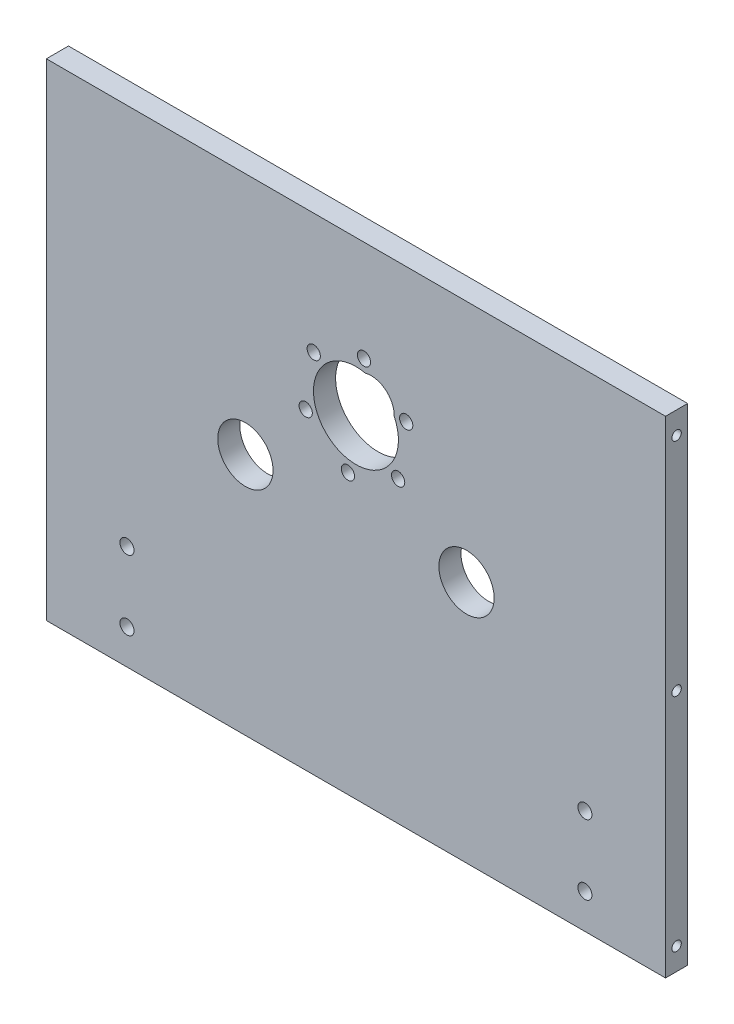
ISO-10303-21;
HEADER;
FILE_DESCRIPTION(('STEP AP214'),'2;1');
FILE_NAME('part.step','',(''),(''),'','','');
FILE_SCHEMA(('AUTOMOTIVE_DESIGN { 1 0 10303 214 1 1 1 1 }'));
ENDSEC;
DATA;
#1=APPLICATION_CONTEXT('core data for automotive mechanical design processes');
#2=APPLICATION_PROTOCOL_DEFINITION('international standard','automotive_design',2000,#1);
#3=PRODUCT_CONTEXT('',#1,'mechanical');
#4=PRODUCT('Part','Part','',(#3));
#5=PRODUCT_RELATED_PRODUCT_CATEGORY('part','',(#4));
#6=PRODUCT_DEFINITION_FORMATION('','',#4);
#7=PRODUCT_DEFINITION_CONTEXT('part definition',#1,'design');
#8=PRODUCT_DEFINITION('design','',#6,#7);
#9=PRODUCT_DEFINITION_SHAPE('','',#8);
#10=(LENGTH_UNIT() NAMED_UNIT(*) SI_UNIT(.MILLI.,.METRE.));
#11=(NAMED_UNIT(*) PLANE_ANGLE_UNIT() SI_UNIT($,.RADIAN.));
#12=(NAMED_UNIT(*) SI_UNIT($,.STERADIAN.) SOLID_ANGLE_UNIT());
#13=UNCERTAINTY_MEASURE_WITH_UNIT(LENGTH_MEASURE(1.E-05),#10,'distance_accuracy_value','');
#14=(GEOMETRIC_REPRESENTATION_CONTEXT(3) GLOBAL_UNCERTAINTY_ASSIGNED_CONTEXT((#13)) GLOBAL_UNIT_ASSIGNED_CONTEXT((#10,
#11,#12)) REPRESENTATION_CONTEXT('',''));
#15=CARTESIAN_POINT('',(0.,0.,0.));
#16=DIRECTION('',(0.,0.,1.));
#17=DIRECTION('',(1.,0.,0.));
#18=AXIS2_PLACEMENT_3D('',#15,#16,#17);
#19=CARTESIAN_POINT('',(0.,0.,6.35));
#20=DIRECTION('',(0.,0.,-1.));
#21=DIRECTION('',(-1.,0.,0.));
#22=AXIS2_PLACEMENT_3D('',#19,#20,#21);
#23=PLANE('',#22);
#24=CARTESIAN_POINT('',(12.1194247924364,15.914264662298,6.34999999999997));
#25=DIRECTION('',(0.,0.,1.));
#26=DIRECTION('',(0.,-1.,0.));
#27=AXIS2_PLACEMENT_3D('',#24,#25,#26);
#28=CIRCLE('',#27,1.89865);
#29=CARTESIAN_POINT('',(12.1194247924364,14.015614662298,6.34999999999997));
#30=VERTEX_POINT('',#29);
#31=EDGE_CURVE('E348',#30,#30,#28,.T.);
#32=ORIENTED_EDGE('',*,*,#31,.F.);
#33=EDGE_LOOP('',(#32));
#34=FACE_BOUND('',#33,.T.);
#35=CARTESIAN_POINT('',(-2.30851065442791,10.2499307437229,6.34999999999999));
#36=DIRECTION('',(0.,0.,1.));
#37=DIRECTION('',(0.,-1.,0.));
#38=AXIS2_PLACEMENT_3D('',#35,#36,#37);
#39=CIRCLE('',#38,1.89865);
#40=CARTESIAN_POINT('',(-2.30851065442791,8.35128074372289,6.34999999999999));
#41=VERTEX_POINT('',#40);
#42=EDGE_CURVE('E359',#41,#41,#39,.T.);
#43=ORIENTED_EDGE('',*,*,#42,.F.);
#44=EDGE_LOOP('',(#43));
#45=FACE_BOUND('',#44,.T.);
#46=CARTESIAN_POINT('',(-14.4279354468638,19.9127224055817,6.35000000000001));
#47=DIRECTION('',(0.,0.,1.));
#48=DIRECTION('',(0.,-1.,0.));
#49=AXIS2_PLACEMENT_3D('',#46,#47,#48);
#50=CIRCLE('',#49,1.89865);
#51=CARTESIAN_POINT('',(-14.4279354468638,18.0140724055817,6.35));
#52=VERTEX_POINT('',#51);
#53=EDGE_CURVE('E367',#52,#52,#50,.T.);
#54=ORIENTED_EDGE('',*,*,#53,.F.);
#55=EDGE_LOOP('',(#54));
#56=FACE_BOUND('',#55,.T.);
#57=CARTESIAN_POINT('',(2.30851065442877,40.9041819045906,6.35));
#58=DIRECTION('',(0.,0.,1.));
#59=DIRECTION('',(1.,0.,0.));
#60=AXIS2_PLACEMENT_3D('',#57,#58,#59);
#61=CIRCLE('',#60,1.89865);
#62=CARTESIAN_POINT('',(4.20716065442877,40.9041819045906,6.35));
#63=VERTEX_POINT('',#62);
#64=EDGE_CURVE('E380',#63,#63,#61,.T.);
#65=ORIENTED_EDGE('',*,*,#64,.F.);
#66=EDGE_LOOP('',(#65));
#67=FACE_BOUND('',#66,.T.);
#68=CARTESIAN_POINT('',(0.,25.5770563241567,6.35));
#69=DIRECTION('',(0.,0.,1.));
#70=DIRECTION('',(1.,0.,0.));
#71=AXIS2_PLACEMENT_3D('',#68,#69,#70);
#72=CIRCLE('',#71,12.192);
#73=CARTESIAN_POINT('',(2.68560134093702,37.469592194927,6.35));
#74=VERTEX_POINT('',#73);
#75=CARTESIAN_POINT('',(10.9956326904948,30.8440218391115,6.35));
#76=VERTEX_POINT('',#75);
#77=EDGE_CURVE('E139',#74,#76,#72,.T.);
#78=ORIENTED_EDGE('',*,*,#77,.F.);
#79=CARTESIAN_POINT('',(4.36384139567862,31.0503449400956,6.35));
#80=DIRECTION('',(0.,0.,-1.));
#81=DIRECTION('',(-1.,0.,0.));
#82=AXIS2_PLACEMENT_3D('',#79,#80,#81);
#83=CIRCLE('',#82,6.635);
#84=EDGE_CURVE('E124',#74,#76,#83,.T.);
#85=ORIENTED_EDGE('',*,*,#84,.T.);
#86=EDGE_LOOP('',(#78,#85));
#87=FACE_BOUND('',#86,.T.);
#88=CARTESIAN_POINT('',(65.750000072,-59.85,6.35));
#89=DIRECTION('',(0.,0.,1.));
#90=DIRECTION('',(1.,0.,0.));
#91=AXIS2_PLACEMENT_3D('',#88,#89,#90);
#92=CIRCLE('',#91,2.01929999999999);
#93=CARTESIAN_POINT('',(67.769300072,-59.85,6.35));
#94=VERTEX_POINT('',#93);
#95=EDGE_CURVE('E138',#94,#94,#92,.T.);
#96=ORIENTED_EDGE('',*,*,#95,.F.);
#97=EDGE_LOOP('',(#96));
#98=FACE_BOUND('',#97,.T.);
#99=CARTESIAN_POINT('',(65.750000072,-39.85,6.35));
#100=DIRECTION('',(0.,0.,1.));
#101=DIRECTION('',(1.,0.,0.));
#102=AXIS2_PLACEMENT_3D('',#99,#100,#101);
#103=CIRCLE('',#102,2.01929999999999);
#104=CARTESIAN_POINT('',(67.769300072,-39.85,6.35));
#105=VERTEX_POINT('',#104);
#106=EDGE_CURVE('E156',#105,#105,#103,.T.);
#107=ORIENTED_EDGE('',*,*,#106,.F.);
#108=EDGE_LOOP('',(#107));
#109=FACE_BOUND('',#108,.T.);
#110=CARTESIAN_POINT('',(-65.750000072,-59.85,6.35));
#111=DIRECTION('',(0.,0.,1.));
#112=DIRECTION('',(1.,0.,0.));
#113=AXIS2_PLACEMENT_3D('',#110,#111,#112);
#114=CIRCLE('',#113,2.01929999999999);
#115=CARTESIAN_POINT('',(-63.730700072,-59.85,6.35));
#116=VERTEX_POINT('',#115);
#117=EDGE_CURVE('E164',#116,#116,#114,.T.);
#118=ORIENTED_EDGE('',*,*,#117,.F.);
#119=EDGE_LOOP('',(#118));
#120=FACE_BOUND('',#119,.T.);
#121=CARTESIAN_POINT('',(-65.750000072,-39.85,6.35));
#122=DIRECTION('',(0.,0.,1.));
#123=DIRECTION('',(1.,0.,0.));
#124=AXIS2_PLACEMENT_3D('',#121,#122,#123);
#125=CIRCLE('',#124,2.01929999999999);
#126=CARTESIAN_POINT('',(-63.730700072,-39.85,6.35));
#127=VERTEX_POINT('',#126);
#128=EDGE_CURVE('E172',#127,#127,#125,.T.);
#129=ORIENTED_EDGE('',*,*,#128,.F.);
#130=EDGE_LOOP('',(#129));
#131=FACE_BOUND('',#130,.T.);
#132=CARTESIAN_POINT('',(-31.75,0.,6.35));
#133=DIRECTION('',(0.,0.,1.));
#134=DIRECTION('',(1.,0.,0.));
#135=AXIS2_PLACEMENT_3D('',#132,#133,#134);
#136=CIRCLE('',#135,7.9375);
#137=CARTESIAN_POINT('',(-23.8125,0.,6.35));
#138=VERTEX_POINT('',#137);
#139=EDGE_CURVE('E234',#138,#138,#136,.T.);
#140=ORIENTED_EDGE('',*,*,#139,.F.);
#141=EDGE_LOOP('',(#140));
#142=FACE_BOUND('',#141,.T.);
#143=CARTESIAN_POINT('',(31.75,0.,6.35));
#144=DIRECTION('',(0.,0.,1.));
#145=DIRECTION('',(-1.,0.,0.));
#146=AXIS2_PLACEMENT_3D('',#143,#144,#145);
#147=CIRCLE('',#146,7.9375);
#148=CARTESIAN_POINT('',(23.8125,0.,6.35));
#149=VERTEX_POINT('',#148);
#150=EDGE_CURVE('E228',#149,#149,#147,.T.);
#151=ORIENTED_EDGE('',*,*,#150,.F.);
#152=EDGE_LOOP('',(#151));
#153=FACE_BOUND('',#152,.T.);
#154=DIRECTION('',(0.,1.,0.));
#155=VECTOR('',#154,1.);
#156=CARTESIAN_POINT('',(88.9,-69.85,6.35));
#157=LINE('',#156,#155);
#158=CARTESIAN_POINT('',(88.9,-69.85,6.35));
#159=VERTEX_POINT('',#158);
#160=CARTESIAN_POINT('',(88.9,69.85,6.35));
#161=VERTEX_POINT('',#160);
#162=EDGE_CURVE('E245',#159,#161,#157,.T.);
#163=ORIENTED_EDGE('',*,*,#162,.T.);
#164=DIRECTION('',(-1.,0.,0.));
#165=VECTOR('',#164,1.);
#166=CARTESIAN_POINT('',(-88.9,69.85,6.35));
#167=LINE('',#166,#165);
#168=CARTESIAN_POINT('',(-88.9,69.85,6.35));
#169=VERTEX_POINT('',#168);
#170=EDGE_CURVE('E97',#161,#169,#167,.T.);
#171=ORIENTED_EDGE('',*,*,#170,.T.);
#172=DIRECTION('',(0.,-1.,0.));
#173=VECTOR('',#172,1.);
#174=CARTESIAN_POINT('',(-88.9,-69.85,6.35));
#175=LINE('',#174,#173);
#176=CARTESIAN_POINT('',(-88.9,-69.85,6.35));
#177=VERTEX_POINT('',#176);
#178=EDGE_CURVE('E250',#169,#177,#175,.T.);
#179=ORIENTED_EDGE('',*,*,#178,.T.);
#180=DIRECTION('',(1.,0.,0.));
#181=VECTOR('',#180,1.);
#182=CARTESIAN_POINT('',(-88.9,-69.85,6.35));
#183=LINE('',#182,#181);
#184=EDGE_CURVE('E68',#177,#159,#183,.T.);
#185=ORIENTED_EDGE('',*,*,#184,.T.);
#186=EDGE_LOOP('',(#163,#171,#179,#185));
#187=FACE_BOUND('',#186,.T.);
#188=CARTESIAN_POINT('',(-12.1194247924355,35.2398479860156,6.35));
#189=DIRECTION('',(0.,0.,1.));
#190=DIRECTION('',(0.,-1.,0.));
#191=AXIS2_PLACEMENT_3D('',#188,#189,#190);
#192=CIRCLE('',#191,1.89865);
#193=CARTESIAN_POINT('',(-12.1194247924355,33.3411979860156,6.35));
#194=VERTEX_POINT('',#193);
#195=EDGE_CURVE('E336',#194,#194,#192,.T.);
#196=ORIENTED_EDGE('',*,*,#195,.F.);
#197=EDGE_LOOP('',(#196));
#198=FACE_BOUND('',#197,.T.);
#199=CARTESIAN_POINT('',(14.4279354468646,31.2413902427319,6.34999999999998));
#200=DIRECTION('',(0.,0.,1.));
#201=DIRECTION('',(0.,-1.,0.));
#202=AXIS2_PLACEMENT_3D('',#199,#200,#201);
#203=CIRCLE('',#202,1.89865);
#204=CARTESIAN_POINT('',(14.4279354468646,29.3427402427319,6.34999999999998));
#205=VERTEX_POINT('',#204);
#206=EDGE_CURVE('E339',#205,#205,#203,.T.);
#207=ORIENTED_EDGE('',*,*,#206,.F.);
#208=EDGE_LOOP('',(#207));
#209=FACE_BOUND('',#208,.T.);
#210=ADVANCED_FACE('F43',(#34,#45,#56,#67,#87,#98,#109,#120,#131,#142,#153,#187,#198,#209),#23,.F.);
#211=CARTESIAN_POINT('',(0.,0.,0.));
#212=DIRECTION('',(0.,0.,-1.));
#213=DIRECTION('',(-1.,0.,0.));
#214=AXIS2_PLACEMENT_3D('',#211,#212,#213);
#215=PLANE('',#214);
#216=CARTESIAN_POINT('',(4.36384139567862,31.0503449400956,0.));
#217=DIRECTION('',(0.,0.,-1.));
#218=DIRECTION('',(-1.,0.,0.));
#219=AXIS2_PLACEMENT_3D('',#216,#217,#218);
#220=CIRCLE('',#219,6.635);
#221=CARTESIAN_POINT('',(2.68560134093702,37.469592194927,0.));
#222=VERTEX_POINT('',#221);
#223=CARTESIAN_POINT('',(10.9956326904948,30.8440218391115,0.));
#224=VERTEX_POINT('',#223);
#225=EDGE_CURVE('E59',#222,#224,#220,.T.);
#226=ORIENTED_EDGE('',*,*,#225,.F.);
#227=CARTESIAN_POINT('',(0.,25.5770563241567,0.));
#228=DIRECTION('',(0.,0.,1.));
#229=DIRECTION('',(1.,0.,0.));
#230=AXIS2_PLACEMENT_3D('',#227,#228,#229);
#231=CIRCLE('',#230,12.192);
#232=EDGE_CURVE('E133',#222,#224,#231,.T.);
#233=ORIENTED_EDGE('',*,*,#232,.T.);
#234=EDGE_LOOP('',(#226,#233));
#235=FACE_BOUND('',#234,.T.);
#236=CARTESIAN_POINT('',(14.4279354468646,31.2413902427319,0.));
#237=DIRECTION('',(0.,0.,1.));
#238=DIRECTION('',(0.,-1.,0.));
#239=AXIS2_PLACEMENT_3D('',#236,#237,#238);
#240=CIRCLE('',#239,1.89865);
#241=CARTESIAN_POINT('',(14.4279354468646,29.3427402427319,0.));
#242=VERTEX_POINT('',#241);
#243=EDGE_CURVE('E342',#242,#242,#240,.T.);
#244=ORIENTED_EDGE('',*,*,#243,.T.);
#245=EDGE_LOOP('',(#244));
#246=FACE_BOUND('',#245,.T.);
#247=CARTESIAN_POINT('',(12.1194247924364,15.914264662298,0.));
#248=DIRECTION('',(0.,0.,1.));
#249=DIRECTION('',(0.,-1.,0.));
#250=AXIS2_PLACEMENT_3D('',#247,#248,#249);
#251=CIRCLE('',#250,1.89865);
#252=CARTESIAN_POINT('',(12.1194247924364,14.015614662298,0.));
#253=VERTEX_POINT('',#252);
#254=EDGE_CURVE('E355',#253,#253,#251,.T.);
#255=ORIENTED_EDGE('',*,*,#254,.T.);
#256=EDGE_LOOP('',(#255));
#257=FACE_BOUND('',#256,.T.);
#258=CARTESIAN_POINT('',(-2.30851065442791,10.2499307437229,0.));
#259=DIRECTION('',(0.,0.,1.));
#260=DIRECTION('',(0.,-1.,0.));
#261=AXIS2_PLACEMENT_3D('',#258,#259,#260);
#262=CIRCLE('',#261,1.89865);
#263=CARTESIAN_POINT('',(-2.30851065442791,8.3512807437229,0.));
#264=VERTEX_POINT('',#263);
#265=EDGE_CURVE('E363',#264,#264,#262,.T.);
#266=ORIENTED_EDGE('',*,*,#265,.T.);
#267=EDGE_LOOP('',(#266));
#268=FACE_BOUND('',#267,.T.);
#269=CARTESIAN_POINT('',(65.750000072,-59.85,0.));
#270=DIRECTION('',(0.,0.,1.));
#271=DIRECTION('',(1.,0.,0.));
#272=AXIS2_PLACEMENT_3D('',#269,#270,#271);
#273=CIRCLE('',#272,2.0193);
#274=CARTESIAN_POINT('',(67.769300072,-59.85,0.));
#275=VERTEX_POINT('',#274);
#276=EDGE_CURVE('E146',#275,#275,#273,.T.);
#277=ORIENTED_EDGE('',*,*,#276,.T.);
#278=EDGE_LOOP('',(#277));
#279=FACE_BOUND('',#278,.T.);
#280=CARTESIAN_POINT('',(65.750000072,-39.85,0.));
#281=DIRECTION('',(0.,0.,1.));
#282=DIRECTION('',(1.,0.,0.));
#283=AXIS2_PLACEMENT_3D('',#280,#281,#282);
#284=CIRCLE('',#283,2.0193);
#285=CARTESIAN_POINT('',(67.769300072,-39.85,0.));
#286=VERTEX_POINT('',#285);
#287=EDGE_CURVE('E160',#286,#286,#284,.T.);
#288=ORIENTED_EDGE('',*,*,#287,.T.);
#289=EDGE_LOOP('',(#288));
#290=FACE_BOUND('',#289,.T.);
#291=CARTESIAN_POINT('',(-65.750000072,-59.85,0.));
#292=DIRECTION('',(0.,0.,1.));
#293=DIRECTION('',(1.,0.,0.));
#294=AXIS2_PLACEMENT_3D('',#291,#292,#293);
#295=CIRCLE('',#294,2.0193);
#296=CARTESIAN_POINT('',(-63.730700072,-59.85,0.));
#297=VERTEX_POINT('',#296);
#298=EDGE_CURVE('E168',#297,#297,#295,.T.);
#299=ORIENTED_EDGE('',*,*,#298,.T.);
#300=EDGE_LOOP('',(#299));
#301=FACE_BOUND('',#300,.T.);
#302=CARTESIAN_POINT('',(-65.750000072,-39.85,0.));
#303=DIRECTION('',(0.,0.,1.));
#304=DIRECTION('',(1.,0.,0.));
#305=AXIS2_PLACEMENT_3D('',#302,#303,#304);
#306=CIRCLE('',#305,2.0193);
#307=CARTESIAN_POINT('',(-63.730700072,-39.85,0.));
#308=VERTEX_POINT('',#307);
#309=EDGE_CURVE('E176',#308,#308,#306,.T.);
#310=ORIENTED_EDGE('',*,*,#309,.T.);
#311=EDGE_LOOP('',(#310));
#312=FACE_BOUND('',#311,.T.);
#313=CARTESIAN_POINT('',(-31.75,0.,0.));
#314=DIRECTION('',(0.,0.,1.));
#315=DIRECTION('',(1.,0.,0.));
#316=AXIS2_PLACEMENT_3D('',#313,#314,#315);
#317=CIRCLE('',#316,7.9375);
#318=CARTESIAN_POINT('',(-23.8125,0.,0.));
#319=VERTEX_POINT('',#318);
#320=EDGE_CURVE('E229',#319,#319,#317,.T.);
#321=ORIENTED_EDGE('',*,*,#320,.T.);
#322=EDGE_LOOP('',(#321));
#323=FACE_BOUND('',#322,.T.);
#324=CARTESIAN_POINT('',(31.75,0.,0.));
#325=DIRECTION('',(0.,0.,1.));
#326=DIRECTION('',(-1.,0.,0.));
#327=AXIS2_PLACEMENT_3D('',#324,#325,#326);
#328=CIRCLE('',#327,7.9375);
#329=CARTESIAN_POINT('',(23.8125,0.,0.));
#330=VERTEX_POINT('',#329);
#331=EDGE_CURVE('E238',#330,#330,#328,.T.);
#332=ORIENTED_EDGE('',*,*,#331,.T.);
#333=EDGE_LOOP('',(#332));
#334=FACE_BOUND('',#333,.T.);
#335=DIRECTION('',(0.,1.,0.));
#336=VECTOR('',#335,1.);
#337=CARTESIAN_POINT('',(88.9,-69.85,0.));
#338=LINE('',#337,#336);
#339=CARTESIAN_POINT('',(88.9,-69.85,0.));
#340=VERTEX_POINT('',#339);
#341=CARTESIAN_POINT('',(88.9,69.85,0.));
#342=VERTEX_POINT('',#341);
#343=EDGE_CURVE('E233',#340,#342,#338,.T.);
#344=ORIENTED_EDGE('',*,*,#343,.F.);
#345=DIRECTION('',(1.,0.,0.));
#346=VECTOR('',#345,1.);
#347=CARTESIAN_POINT('',(-88.9,-69.85,0.));
#348=LINE('',#347,#346);
#349=CARTESIAN_POINT('',(-88.9,-69.85,0.));
#350=VERTEX_POINT('',#349);
#351=EDGE_CURVE('E89',#350,#340,#348,.T.);
#352=ORIENTED_EDGE('',*,*,#351,.F.);
#353=DIRECTION('',(0.,-1.,0.));
#354=VECTOR('',#353,1.);
#355=CARTESIAN_POINT('',(-88.9,-69.85,0.));
#356=LINE('',#355,#354);
#357=CARTESIAN_POINT('',(-88.9,69.85,0.));
#358=VERTEX_POINT('',#357);
#359=EDGE_CURVE('E262',#358,#350,#356,.T.);
#360=ORIENTED_EDGE('',*,*,#359,.F.);
#361=DIRECTION('',(-1.,0.,0.));
#362=VECTOR('',#361,1.);
#363=CARTESIAN_POINT('',(-88.9,69.85,0.));
#364=LINE('',#363,#362);
#365=EDGE_CURVE('E259',#342,#358,#364,.T.);
#366=ORIENTED_EDGE('',*,*,#365,.F.);
#367=EDGE_LOOP('',(#344,#352,#360,#366));
#368=FACE_BOUND('',#367,.T.);
#369=CARTESIAN_POINT('',(2.30851065442877,40.9041819045906,0.));
#370=DIRECTION('',(0.,0.,1.));
#371=DIRECTION('',(1.,0.,0.));
#372=AXIS2_PLACEMENT_3D('',#369,#370,#371);
#373=CIRCLE('',#372,1.89865);
#374=CARTESIAN_POINT('',(4.20716065442877,40.9041819045906,0.));
#375=VERTEX_POINT('',#374);
#376=EDGE_CURVE('E148',#375,#375,#373,.T.);
#377=ORIENTED_EDGE('',*,*,#376,.T.);
#378=EDGE_LOOP('',(#377));
#379=FACE_BOUND('',#378,.T.);
#380=CARTESIAN_POINT('',(-12.1194247924355,35.2398479860157,0.));
#381=DIRECTION('',(0.,0.,1.));
#382=DIRECTION('',(0.,-1.,0.));
#383=AXIS2_PLACEMENT_3D('',#380,#381,#382);
#384=CIRCLE('',#383,1.89865);
#385=CARTESIAN_POINT('',(-12.1194247924355,33.3411979860157,0.));
#386=VERTEX_POINT('',#385);
#387=EDGE_CURVE('E377',#386,#386,#384,.T.);
#388=ORIENTED_EDGE('',*,*,#387,.T.);
#389=EDGE_LOOP('',(#388));
#390=FACE_BOUND('',#389,.T.);
#391=CARTESIAN_POINT('',(-14.4279354468638,19.9127224055817,0.));
#392=DIRECTION('',(0.,0.,1.));
#393=DIRECTION('',(0.,-1.,0.));
#394=AXIS2_PLACEMENT_3D('',#391,#392,#393);
#395=CIRCLE('',#394,1.89865);
#396=CARTESIAN_POINT('',(-14.4279354468638,18.0140724055817,0.));
#397=VERTEX_POINT('',#396);
#398=EDGE_CURVE('E371',#397,#397,#395,.T.);
#399=ORIENTED_EDGE('',*,*,#398,.T.);
#400=EDGE_LOOP('',(#399));
#401=FACE_BOUND('',#400,.T.);
#402=ADVANCED_FACE('F131',(#235,#246,#257,#268,#279,#290,#301,#312,#323,#334,#368,#379,#390,
#401),#215,.T.);
#403=CARTESIAN_POINT('',(88.9,-69.85,6.35));
#404=DIRECTION('',(-1.,0.,0.));
#405=DIRECTION('',(0.,0.,1.));
#406=AXIS2_PLACEMENT_3D('',#403,#404,#405);
#407=PLANE('',#406);
#408=CARTESIAN_POINT('',(88.9,63.5,3.175));
#409=DIRECTION('',(1.,0.,0.));
#410=DIRECTION('',(0.,0.,-1.));
#411=AXIS2_PLACEMENT_3D('',#408,#409,#410);
#412=CIRCLE('',#411,1.35254999999999);
#413=CARTESIAN_POINT('',(88.9,63.5,1.82245000000001));
#414=VERTEX_POINT('',#413);
#415=EDGE_CURVE('E204',#414,#414,#412,.T.);
#416=ORIENTED_EDGE('',*,*,#415,.F.);
#417=EDGE_LOOP('',(#416));
#418=FACE_BOUND('',#417,.T.);
#419=CARTESIAN_POINT('',(88.9,0.,3.175));
#420=DIRECTION('',(1.,0.,0.));
#421=DIRECTION('',(0.,0.,-1.));
#422=AXIS2_PLACEMENT_3D('',#419,#420,#421);
#423=CIRCLE('',#422,1.35254999999999);
#424=CARTESIAN_POINT('',(88.9,0.,1.82245000000001));
#425=VERTEX_POINT('',#424);
#426=EDGE_CURVE('E212',#425,#425,#423,.T.);
#427=ORIENTED_EDGE('',*,*,#426,.F.);
#428=EDGE_LOOP('',(#427));
#429=FACE_BOUND('',#428,.T.);
#430=CARTESIAN_POINT('',(88.9,-63.5,3.175));
#431=DIRECTION('',(1.,0.,0.));
#432=DIRECTION('',(0.,0.,-1.));
#433=AXIS2_PLACEMENT_3D('',#430,#431,#432);
#434=CIRCLE('',#433,1.35254999999999);
#435=CARTESIAN_POINT('',(88.9,-63.5,1.82245000000001));
#436=VERTEX_POINT('',#435);
#437=EDGE_CURVE('E220',#436,#436,#434,.T.);
#438=ORIENTED_EDGE('',*,*,#437,.F.);
#439=EDGE_LOOP('',(#438));
#440=FACE_BOUND('',#439,.T.);
#441=ORIENTED_EDGE('',*,*,#343,.T.);
#442=DIRECTION('',(0.,0.,-1.));
#443=VECTOR('',#442,1.);
#444=CARTESIAN_POINT('',(88.9,69.85,6.35));
#445=LINE('',#444,#443);
#446=EDGE_CURVE('E276',#161,#342,#445,.T.);
#447=ORIENTED_EDGE('',*,*,#446,.F.);
#448=ORIENTED_EDGE('',*,*,#162,.F.);
#449=DIRECTION('',(0.,0.,-1.));
#450=VECTOR('',#449,1.);
#451=CARTESIAN_POINT('',(88.9,-69.85,6.35));
#452=LINE('',#451,#450);
#453=EDGE_CURVE('E255',#159,#340,#452,.T.);
#454=ORIENTED_EDGE('',*,*,#453,.T.);
#455=EDGE_LOOP('',(#441,#447,#448,#454));
#456=FACE_BOUND('',#455,.T.);
#457=ADVANCED_FACE('F45',(#418,#429,#440,#456),#407,.F.);
#458=CARTESIAN_POINT('',(-88.9,69.85,6.35));
#459=DIRECTION('',(0.,-1.,0.));
#460=DIRECTION('',(0.,0.,-1.));
#461=AXIS2_PLACEMENT_3D('',#458,#459,#460);
#462=PLANE('',#461);
#463=ORIENTED_EDGE('',*,*,#365,.T.);
#464=DIRECTION('',(0.,0.,-1.));
#465=VECTOR('',#464,1.);
#466=CARTESIAN_POINT('',(-88.9,69.85,6.35));
#467=LINE('',#466,#465);
#468=EDGE_CURVE('E272',#169,#358,#467,.T.);
#469=ORIENTED_EDGE('',*,*,#468,.F.);
#470=ORIENTED_EDGE('',*,*,#170,.F.);
#471=ORIENTED_EDGE('',*,*,#446,.T.);
#472=EDGE_LOOP('',(#463,#469,#470,#471));
#473=FACE_BOUND('',#472,.T.);
#474=ADVANCED_FACE('F317',(#473),#462,.F.);
#475=CARTESIAN_POINT('',(-88.9,-69.85,6.35));
#476=DIRECTION('',(1.,0.,0.));
#477=DIRECTION('',(0.,0.,-1.));
#478=AXIS2_PLACEMENT_3D('',#475,#476,#477);
#479=PLANE('',#478);
#480=CARTESIAN_POINT('',(-88.9,63.5,3.175));
#481=DIRECTION('',(-1.,0.,0.));
#482=DIRECTION('',(0.,0.,1.));
#483=AXIS2_PLACEMENT_3D('',#480,#481,#482);
#484=CIRCLE('',#483,1.35254999999999);
#485=CARTESIAN_POINT('',(-88.9,63.5,4.52754999999999));
#486=VERTEX_POINT('',#485);
#487=EDGE_CURVE('E180',#486,#486,#484,.T.);
#488=ORIENTED_EDGE('',*,*,#487,.F.);
#489=EDGE_LOOP('',(#488));
#490=FACE_BOUND('',#489,.T.);
#491=CARTESIAN_POINT('',(-88.9,0.,3.175));
#492=DIRECTION('',(-1.,0.,0.));
#493=DIRECTION('',(0.,0.,1.));
#494=AXIS2_PLACEMENT_3D('',#491,#492,#493);
#495=CIRCLE('',#494,1.35254999999999);
#496=CARTESIAN_POINT('',(-88.9,0.,4.52754999999999));
#497=VERTEX_POINT('',#496);
#498=EDGE_CURVE('E188',#497,#497,#495,.T.);
#499=ORIENTED_EDGE('',*,*,#498,.F.);
#500=EDGE_LOOP('',(#499));
#501=FACE_BOUND('',#500,.T.);
#502=CARTESIAN_POINT('',(-88.9,-63.5,3.175));
#503=DIRECTION('',(-1.,0.,0.));
#504=DIRECTION('',(0.,0.,1.));
#505=AXIS2_PLACEMENT_3D('',#502,#503,#504);
#506=CIRCLE('',#505,1.35254999999999);
#507=CARTESIAN_POINT('',(-88.9,-63.5,4.52754999999999));
#508=VERTEX_POINT('',#507);
#509=EDGE_CURVE('E196',#508,#508,#506,.T.);
#510=ORIENTED_EDGE('',*,*,#509,.F.);
#511=EDGE_LOOP('',(#510));
#512=FACE_BOUND('',#511,.T.);
#513=ORIENTED_EDGE('',*,*,#359,.T.);
#514=DIRECTION('',(0.,0.,-1.));
#515=VECTOR('',#514,1.);
#516=CARTESIAN_POINT('',(-88.9,-69.85,6.35));
#517=LINE('',#516,#515);
#518=EDGE_CURVE('E269',#177,#350,#517,.T.);
#519=ORIENTED_EDGE('',*,*,#518,.F.);
#520=ORIENTED_EDGE('',*,*,#178,.F.);
#521=ORIENTED_EDGE('',*,*,#468,.T.);
#522=EDGE_LOOP('',(#513,#519,#520,#521));
#523=FACE_BOUND('',#522,.T.);
#524=ADVANCED_FACE('F326',(#490,#501,#512,#523),#479,.F.);
#525=CARTESIAN_POINT('',(-88.9,-69.85,6.35));
#526=DIRECTION('',(0.,1.,0.));
#527=DIRECTION('',(0.,0.,1.));
#528=AXIS2_PLACEMENT_3D('',#525,#526,#527);
#529=PLANE('',#528);
#530=ORIENTED_EDGE('',*,*,#351,.T.);
#531=ORIENTED_EDGE('',*,*,#453,.F.);
#532=ORIENTED_EDGE('',*,*,#184,.F.);
#533=ORIENTED_EDGE('',*,*,#518,.T.);
#534=EDGE_LOOP('',(#530,#531,#532,#533));
#535=FACE_BOUND('',#534,.T.);
#536=ADVANCED_FACE('F328',(#535),#529,.F.);
#537=CARTESIAN_POINT('',(31.75,0.,0.));
#538=DIRECTION('',(0.,0.,1.));
#539=DIRECTION('',(1.,0.,0.));
#540=AXIS2_PLACEMENT_3D('',#537,#538,#539);
#541=CYLINDRICAL_SURFACE('',#540,7.9375);
#542=ORIENTED_EDGE('',*,*,#331,.F.);
#543=EDGE_LOOP('',(#542));
#544=FACE_BOUND('',#543,.T.);
#545=ORIENTED_EDGE('',*,*,#150,.T.);
#546=EDGE_LOOP('',(#545));
#547=FACE_BOUND('',#546,.T.);
#548=ADVANCED_FACE('F473',(#544,#547),#541,.F.);
#549=CARTESIAN_POINT('',(-31.75,0.,0.));
#550=DIRECTION('',(0.,0.,1.));
#551=DIRECTION('',(1.,0.,0.));
#552=AXIS2_PLACEMENT_3D('',#549,#550,#551);
#553=CYLINDRICAL_SURFACE('',#552,7.9375);
#554=ORIENTED_EDGE('',*,*,#320,.F.);
#555=EDGE_LOOP('',(#554));
#556=FACE_BOUND('',#555,.T.);
#557=ORIENTED_EDGE('',*,*,#139,.T.);
#558=EDGE_LOOP('',(#557));
#559=FACE_BOUND('',#558,.T.);
#560=ADVANCED_FACE('F469',(#556,#559),#553,.F.);
#561=CARTESIAN_POINT('',(76.2,-63.5,3.175));
#562=DIRECTION('',(1.,0.,0.));
#563=DIRECTION('',(0.,0.,-1.));
#564=AXIS2_PLACEMENT_3D('',#561,#562,#563);
#565=CONICAL_SURFACE('',#564,1.35254999999999,1.02974425867665);
#566=CARTESIAN_POINT('',(75.3873059697343,-63.5,3.175));
#567=VERTEX_POINT('',#566);
#568=VERTEX_LOOP('',#567);
#569=FACE_BOUND('',#568,.T.);
#570=CARTESIAN_POINT('',(76.2,-63.5,3.175));
#571=DIRECTION('',(1.,0.,0.));
#572=DIRECTION('',(0.,0.,-1.));
#573=AXIS2_PLACEMENT_3D('',#570,#571,#572);
#574=CIRCLE('',#573,1.35254999999999);
#575=CARTESIAN_POINT('',(76.2,-63.5,1.82245000000001));
#576=VERTEX_POINT('',#575);
#577=EDGE_CURVE('E224',#576,#576,#574,.T.);
#578=ORIENTED_EDGE('',*,*,#577,.T.);
#579=EDGE_LOOP('',(#578));
#580=FACE_BOUND('',#579,.T.);
#581=ADVANCED_FACE('F465',(#569,#580),#565,.F.);
#582=CARTESIAN_POINT('',(88.9,-63.5,3.175));
#583=DIRECTION('',(1.,0.,0.));
#584=DIRECTION('',(0.,0.,-1.));
#585=AXIS2_PLACEMENT_3D('',#582,#583,#584);
#586=CYLINDRICAL_SURFACE('',#585,1.35254999999999);
#587=ORIENTED_EDGE('',*,*,#577,.F.);
#588=EDGE_LOOP('',(#587));
#589=FACE_BOUND('',#588,.T.);
#590=ORIENTED_EDGE('',*,*,#437,.T.);
#591=EDGE_LOOP('',(#590));
#592=FACE_BOUND('',#591,.T.);
#593=ADVANCED_FACE('F461',(#589,#592),#586,.F.);
#594=CARTESIAN_POINT('',(76.2,0.,3.175));
#595=DIRECTION('',(1.,0.,0.));
#596=DIRECTION('',(0.,0.,-1.));
#597=AXIS2_PLACEMENT_3D('',#594,#595,#596);
#598=CONICAL_SURFACE('',#597,1.35255,1.02974425867665);
#599=CARTESIAN_POINT('',(75.3873059697343,0.,3.175));
#600=VERTEX_POINT('',#599);
#601=VERTEX_LOOP('',#600);
#602=FACE_BOUND('',#601,.T.);
#603=CARTESIAN_POINT('',(76.2,0.,3.175));
#604=DIRECTION('',(1.,0.,0.));
#605=DIRECTION('',(0.,0.,-1.));
#606=AXIS2_PLACEMENT_3D('',#603,#604,#605);
#607=CIRCLE('',#606,1.35255);
#608=CARTESIAN_POINT('',(76.2,0.,1.82245));
#609=VERTEX_POINT('',#608);
#610=EDGE_CURVE('E216',#609,#609,#607,.T.);
#611=ORIENTED_EDGE('',*,*,#610,.T.);
#612=EDGE_LOOP('',(#611));
#613=FACE_BOUND('',#612,.T.);
#614=ADVANCED_FACE('F457',(#602,#613),#598,.F.);
#615=CARTESIAN_POINT('',(88.9,0.,3.175));
#616=DIRECTION('',(1.,0.,0.));
#617=DIRECTION('',(0.,0.,-1.));
#618=AXIS2_PLACEMENT_3D('',#615,#616,#617);
#619=CYLINDRICAL_SURFACE('',#618,1.35254999999999);
#620=ORIENTED_EDGE('',*,*,#610,.F.);
#621=EDGE_LOOP('',(#620));
#622=FACE_BOUND('',#621,.T.);
#623=ORIENTED_EDGE('',*,*,#426,.T.);
#624=EDGE_LOOP('',(#623));
#625=FACE_BOUND('',#624,.T.);
#626=ADVANCED_FACE('F453',(#622,#625),#619,.F.);
#627=CARTESIAN_POINT('',(76.2,63.5,3.175));
#628=DIRECTION('',(1.,0.,0.));
#629=DIRECTION('',(0.,0.,-1.));
#630=AXIS2_PLACEMENT_3D('',#627,#628,#629);
#631=CONICAL_SURFACE('',#630,1.35254999999999,1.02974425867665);
#632=CARTESIAN_POINT('',(75.3873059697343,63.5,3.175));
#633=VERTEX_POINT('',#632);
#634=VERTEX_LOOP('',#633);
#635=FACE_BOUND('',#634,.T.);
#636=CARTESIAN_POINT('',(76.2,63.5,3.175));
#637=DIRECTION('',(1.,0.,0.));
#638=DIRECTION('',(0.,0.,-1.));
#639=AXIS2_PLACEMENT_3D('',#636,#637,#638);
#640=CIRCLE('',#639,1.35254999999999);
#641=CARTESIAN_POINT('',(76.2,63.5,1.82245000000001));
#642=VERTEX_POINT('',#641);
#643=EDGE_CURVE('E208',#642,#642,#640,.T.);
#644=ORIENTED_EDGE('',*,*,#643,.T.);
#645=EDGE_LOOP('',(#644));
#646=FACE_BOUND('',#645,.T.);
#647=ADVANCED_FACE('F449',(#635,#646),#631,.F.);
#648=CARTESIAN_POINT('',(88.9,63.5,3.175));
#649=DIRECTION('',(1.,0.,0.));
#650=DIRECTION('',(0.,0.,-1.));
#651=AXIS2_PLACEMENT_3D('',#648,#649,#650);
#652=CYLINDRICAL_SURFACE('',#651,1.35254999999999);
#653=ORIENTED_EDGE('',*,*,#643,.F.);
#654=EDGE_LOOP('',(#653));
#655=FACE_BOUND('',#654,.T.);
#656=ORIENTED_EDGE('',*,*,#415,.T.);
#657=EDGE_LOOP('',(#656));
#658=FACE_BOUND('',#657,.T.);
#659=ADVANCED_FACE('F445',(#655,#658),#652,.F.);
#660=CARTESIAN_POINT('',(-76.2,-63.5,3.175));
#661=DIRECTION('',(-1.,0.,0.));
#662=DIRECTION('',(0.,0.,1.));
#663=AXIS2_PLACEMENT_3D('',#660,#661,#662);
#664=CONICAL_SURFACE('',#663,1.35254999999999,1.02974425867665);
#665=CARTESIAN_POINT('',(-75.3873059697343,-63.5,3.175));
#666=VERTEX_POINT('',#665);
#667=VERTEX_LOOP('',#666);
#668=FACE_BOUND('',#667,.T.);
#669=CARTESIAN_POINT('',(-76.2,-63.5,3.175));
#670=DIRECTION('',(-1.,0.,0.));
#671=DIRECTION('',(0.,0.,1.));
#672=AXIS2_PLACEMENT_3D('',#669,#670,#671);
#673=CIRCLE('',#672,1.35254999999999);
#674=CARTESIAN_POINT('',(-76.2,-63.5,4.52754999999999));
#675=VERTEX_POINT('',#674);
#676=EDGE_CURVE('E200',#675,#675,#673,.T.);
#677=ORIENTED_EDGE('',*,*,#676,.T.);
#678=EDGE_LOOP('',(#677));
#679=FACE_BOUND('',#678,.T.);
#680=ADVANCED_FACE('F441',(#668,#679),#664,.F.);
#681=CARTESIAN_POINT('',(-88.9,-63.5,3.175));
#682=DIRECTION('',(-1.,0.,0.));
#683=DIRECTION('',(0.,0.,1.));
#684=AXIS2_PLACEMENT_3D('',#681,#682,#683);
#685=CYLINDRICAL_SURFACE('',#684,1.35254999999999);
#686=ORIENTED_EDGE('',*,*,#676,.F.);
#687=EDGE_LOOP('',(#686));
#688=FACE_BOUND('',#687,.T.);
#689=ORIENTED_EDGE('',*,*,#509,.T.);
#690=EDGE_LOOP('',(#689));
#691=FACE_BOUND('',#690,.T.);
#692=ADVANCED_FACE('F437',(#688,#691),#685,.F.);
#693=CARTESIAN_POINT('',(-76.2,0.,3.175));
#694=DIRECTION('',(-1.,0.,0.));
#695=DIRECTION('',(0.,0.,1.));
#696=AXIS2_PLACEMENT_3D('',#693,#694,#695);
#697=CONICAL_SURFACE('',#696,1.35255,1.02974425867665);
#698=CARTESIAN_POINT('',(-75.3873059697343,0.,3.175));
#699=VERTEX_POINT('',#698);
#700=VERTEX_LOOP('',#699);
#701=FACE_BOUND('',#700,.T.);
#702=CARTESIAN_POINT('',(-76.2,0.,3.175));
#703=DIRECTION('',(-1.,0.,0.));
#704=DIRECTION('',(0.,0.,1.));
#705=AXIS2_PLACEMENT_3D('',#702,#703,#704);
#706=CIRCLE('',#705,1.35255);
#707=CARTESIAN_POINT('',(-76.2,0.,4.52755));
#708=VERTEX_POINT('',#707);
#709=EDGE_CURVE('E192',#708,#708,#706,.T.);
#710=ORIENTED_EDGE('',*,*,#709,.T.);
#711=EDGE_LOOP('',(#710));
#712=FACE_BOUND('',#711,.T.);
#713=ADVANCED_FACE('F433',(#701,#712),#697,.F.);
#714=CARTESIAN_POINT('',(-88.9,0.,3.175));
#715=DIRECTION('',(-1.,0.,0.));
#716=DIRECTION('',(0.,0.,1.));
#717=AXIS2_PLACEMENT_3D('',#714,#715,#716);
#718=CYLINDRICAL_SURFACE('',#717,1.35254999999999);
#719=ORIENTED_EDGE('',*,*,#709,.F.);
#720=EDGE_LOOP('',(#719));
#721=FACE_BOUND('',#720,.T.);
#722=ORIENTED_EDGE('',*,*,#498,.T.);
#723=EDGE_LOOP('',(#722));
#724=FACE_BOUND('',#723,.T.);
#725=ADVANCED_FACE('F429',(#721,#724),#718,.F.);
#726=CARTESIAN_POINT('',(-76.2,63.5,3.175));
#727=DIRECTION('',(-1.,0.,0.));
#728=DIRECTION('',(0.,0.,1.));
#729=AXIS2_PLACEMENT_3D('',#726,#727,#728);
#730=CONICAL_SURFACE('',#729,1.35254999999999,1.02974425867665);
#731=CARTESIAN_POINT('',(-75.3873059697343,63.5,3.175));
#732=VERTEX_POINT('',#731);
#733=VERTEX_LOOP('',#732);
#734=FACE_BOUND('',#733,.T.);
#735=CARTESIAN_POINT('',(-76.2,63.5,3.175));
#736=DIRECTION('',(-1.,0.,0.));
#737=DIRECTION('',(0.,0.,1.));
#738=AXIS2_PLACEMENT_3D('',#735,#736,#737);
#739=CIRCLE('',#738,1.35254999999999);
#740=CARTESIAN_POINT('',(-76.2,63.5,4.52754999999999));
#741=VERTEX_POINT('',#740);
#742=EDGE_CURVE('E184',#741,#741,#739,.T.);
#743=ORIENTED_EDGE('',*,*,#742,.T.);
#744=EDGE_LOOP('',(#743));
#745=FACE_BOUND('',#744,.T.);
#746=ADVANCED_FACE('F425',(#734,#745),#730,.F.);
#747=CARTESIAN_POINT('',(-88.9,63.5,3.175));
#748=DIRECTION('',(-1.,0.,0.));
#749=DIRECTION('',(0.,0.,1.));
#750=AXIS2_PLACEMENT_3D('',#747,#748,#749);
#751=CYLINDRICAL_SURFACE('',#750,1.35254999999999);
#752=ORIENTED_EDGE('',*,*,#742,.F.);
#753=EDGE_LOOP('',(#752));
#754=FACE_BOUND('',#753,.T.);
#755=ORIENTED_EDGE('',*,*,#487,.T.);
#756=EDGE_LOOP('',(#755));
#757=FACE_BOUND('',#756,.T.);
#758=ADVANCED_FACE('F421',(#754,#757),#751,.F.);
#759=CARTESIAN_POINT('',(-65.750000072,-39.85,6.35));
#760=DIRECTION('',(0.,0.,1.));
#761=DIRECTION('',(1.,0.,0.));
#762=AXIS2_PLACEMENT_3D('',#759,#760,#761);
#763=CYLINDRICAL_SURFACE('',#762,2.01929999999999);
#764=ORIENTED_EDGE('',*,*,#309,.F.);
#765=EDGE_LOOP('',(#764));
#766=FACE_BOUND('',#765,.T.);
#767=ORIENTED_EDGE('',*,*,#128,.T.);
#768=EDGE_LOOP('',(#767));
#769=FACE_BOUND('',#768,.T.);
#770=ADVANCED_FACE('F417',(#766,#769),#763,.F.);
#771=CARTESIAN_POINT('',(-65.750000072,-59.85,6.35));
#772=DIRECTION('',(0.,0.,1.));
#773=DIRECTION('',(1.,0.,0.));
#774=AXIS2_PLACEMENT_3D('',#771,#772,#773);
#775=CYLINDRICAL_SURFACE('',#774,2.01929999999999);
#776=ORIENTED_EDGE('',*,*,#298,.F.);
#777=EDGE_LOOP('',(#776));
#778=FACE_BOUND('',#777,.T.);
#779=ORIENTED_EDGE('',*,*,#117,.T.);
#780=EDGE_LOOP('',(#779));
#781=FACE_BOUND('',#780,.T.);
#782=ADVANCED_FACE('F413',(#778,#781),#775,.F.);
#783=CARTESIAN_POINT('',(65.750000072,-39.85,6.35));
#784=DIRECTION('',(0.,0.,1.));
#785=DIRECTION('',(1.,0.,0.));
#786=AXIS2_PLACEMENT_3D('',#783,#784,#785);
#787=CYLINDRICAL_SURFACE('',#786,2.01929999999999);
#788=ORIENTED_EDGE('',*,*,#287,.F.);
#789=EDGE_LOOP('',(#788));
#790=FACE_BOUND('',#789,.T.);
#791=ORIENTED_EDGE('',*,*,#106,.T.);
#792=EDGE_LOOP('',(#791));
#793=FACE_BOUND('',#792,.T.);
#794=ADVANCED_FACE('F409',(#790,#793),#787,.F.);
#795=CARTESIAN_POINT('',(65.750000072,-59.85,6.35));
#796=DIRECTION('',(0.,0.,1.));
#797=DIRECTION('',(1.,0.,0.));
#798=AXIS2_PLACEMENT_3D('',#795,#796,#797);
#799=CYLINDRICAL_SURFACE('',#798,2.01929999999999);
#800=ORIENTED_EDGE('',*,*,#276,.F.);
#801=EDGE_LOOP('',(#800));
#802=FACE_BOUND('',#801,.T.);
#803=ORIENTED_EDGE('',*,*,#95,.T.);
#804=EDGE_LOOP('',(#803));
#805=FACE_BOUND('',#804,.T.);
#806=ADVANCED_FACE('F403',(#802,#805),#799,.F.);
#807=CARTESIAN_POINT('',(0.,25.5770563241567,0.));
#808=DIRECTION('',(0.,0.,1.));
#809=DIRECTION('',(1.,0.,0.));
#810=AXIS2_PLACEMENT_3D('',#807,#808,#809);
#811=CYLINDRICAL_SURFACE('',#810,12.192);
#812=ORIENTED_EDGE('',*,*,#232,.F.);
#813=DIRECTION('',(0.,0.,-1.));
#814=VECTOR('',#813,1.);
#815=CARTESIAN_POINT('',(2.68560134093702,37.469592194927,3.175));
#816=LINE('',#815,#814);
#817=EDGE_CURVE('E11',#222,#74,#816,.F.);
#818=ORIENTED_EDGE('',*,*,#817,.T.);
#819=ORIENTED_EDGE('',*,*,#77,.T.);
#820=DIRECTION('',(0.,0.,-1.));
#821=VECTOR('',#820,1.);
#822=CARTESIAN_POINT('',(10.9956326904948,30.8440218391115,3.175));
#823=LINE('',#822,#821);
#824=EDGE_CURVE('E52',#76,#224,#823,.T.);
#825=ORIENTED_EDGE('',*,*,#824,.T.);
#826=EDGE_LOOP('',(#812,#818,#819,#825));
#827=FACE_BOUND('',#826,.T.);
#828=ADVANCED_FACE('F136',(#827),#811,.F.);
#829=CARTESIAN_POINT('',(2.30851065442877,40.9041819045906,6.35));
#830=DIRECTION('',(0.,0.,1.));
#831=DIRECTION('',(1.,0.,0.));
#832=AXIS2_PLACEMENT_3D('',#829,#830,#831);
#833=CYLINDRICAL_SURFACE('',#832,1.89865);
#834=ORIENTED_EDGE('',*,*,#376,.F.);
#835=EDGE_LOOP('',(#834));
#836=FACE_BOUND('',#835,.T.);
#837=ORIENTED_EDGE('',*,*,#64,.T.);
#838=EDGE_LOOP('',(#837));
#839=FACE_BOUND('',#838,.T.);
#840=ADVANCED_FACE('F392',(#836,#839),#833,.F.);
#841=CARTESIAN_POINT('',(-12.1194247924355,35.2398479860156,6.35));
#842=DIRECTION('',(0.,0.,1.));
#843=DIRECTION('',(0.,-1.,0.));
#844=AXIS2_PLACEMENT_3D('',#841,#842,#843);
#845=CYLINDRICAL_SURFACE('',#844,1.89865);
#846=ORIENTED_EDGE('',*,*,#387,.F.);
#847=EDGE_LOOP('',(#846));
#848=FACE_BOUND('',#847,.T.);
#849=ORIENTED_EDGE('',*,*,#195,.T.);
#850=EDGE_LOOP('',(#849));
#851=FACE_BOUND('',#850,.T.);
#852=ADVANCED_FACE('F394',(#848,#851),#845,.F.);
#853=CARTESIAN_POINT('',(-14.4279354468638,19.9127224055817,6.35000000000001));
#854=DIRECTION('',(0.,0.,1.));
#855=DIRECTION('',(0.,-1.,0.));
#856=AXIS2_PLACEMENT_3D('',#853,#854,#855);
#857=CYLINDRICAL_SURFACE('',#856,1.89865);
#858=ORIENTED_EDGE('',*,*,#398,.F.);
#859=EDGE_LOOP('',(#858));
#860=FACE_BOUND('',#859,.T.);
#861=ORIENTED_EDGE('',*,*,#53,.T.);
#862=EDGE_LOOP('',(#861));
#863=FACE_BOUND('',#862,.T.);
#864=ADVANCED_FACE('F400',(#860,#863),#857,.F.);
#865=CARTESIAN_POINT('',(-2.30851065442791,10.2499307437229,6.34999999999999));
#866=DIRECTION('',(0.,0.,1.));
#867=DIRECTION('',(0.,-1.,0.));
#868=AXIS2_PLACEMENT_3D('',#865,#866,#867);
#869=CYLINDRICAL_SURFACE('',#868,1.89865);
#870=ORIENTED_EDGE('',*,*,#265,.F.);
#871=EDGE_LOOP('',(#870));
#872=FACE_BOUND('',#871,.T.);
#873=ORIENTED_EDGE('',*,*,#42,.T.);
#874=EDGE_LOOP('',(#873));
#875=FACE_BOUND('',#874,.T.);
#876=ADVANCED_FACE('F533',(#872,#875),#869,.F.);
#877=CARTESIAN_POINT('',(12.1194247924364,15.914264662298,6.34999999999997));
#878=DIRECTION('',(0.,0.,1.));
#879=DIRECTION('',(0.,-1.,0.));
#880=AXIS2_PLACEMENT_3D('',#877,#878,#879);
#881=CYLINDRICAL_SURFACE('',#880,1.89865);
#882=ORIENTED_EDGE('',*,*,#254,.F.);
#883=EDGE_LOOP('',(#882));
#884=FACE_BOUND('',#883,.T.);
#885=ORIENTED_EDGE('',*,*,#31,.T.);
#886=EDGE_LOOP('',(#885));
#887=FACE_BOUND('',#886,.T.);
#888=ADVANCED_FACE('F521',(#884,#887),#881,.F.);
#889=CARTESIAN_POINT('',(14.4279354468646,31.2413902427319,6.34999999999998));
#890=DIRECTION('',(0.,0.,1.));
#891=DIRECTION('',(0.,-1.,0.));
#892=AXIS2_PLACEMENT_3D('',#889,#890,#891);
#893=CYLINDRICAL_SURFACE('',#892,1.89865);
#894=ORIENTED_EDGE('',*,*,#243,.F.);
#895=EDGE_LOOP('',(#894));
#896=FACE_BOUND('',#895,.T.);
#897=ORIENTED_EDGE('',*,*,#206,.T.);
#898=EDGE_LOOP('',(#897));
#899=FACE_BOUND('',#898,.T.);
#900=ADVANCED_FACE('F516',(#896,#899),#893,.F.);
#901=CARTESIAN_POINT('',(4.36384139567862,31.0503449400956,6.35));
#902=DIRECTION('',(0.,0.,-1.));
#903=DIRECTION('',(-1.,0.,0.));
#904=AXIS2_PLACEMENT_3D('',#901,#902,#903);
#905=CYLINDRICAL_SURFACE('',#904,6.635);
#906=ORIENTED_EDGE('',*,*,#225,.T.);
#907=ORIENTED_EDGE('',*,*,#824,.F.);
#908=ORIENTED_EDGE('',*,*,#84,.F.);
#909=ORIENTED_EDGE('',*,*,#817,.F.);
#910=EDGE_LOOP('',(#906,#907,#908,#909));
#911=FACE_BOUND('',#910,.T.);
#912=ADVANCED_FACE('F122',(#911),#905,.F.);
#913=CLOSED_SHELL('',(#210,#402,#457,#474,#524,#536,#548,#560,#581,#593,#614,#626,#647,#659,
#680,#692,#713,#725,#746,#758,#770,#782,#794,#806,#828,#840,#852,#864,#876,#888,#900,#912));
#914=MANIFOLD_SOLID_BREP('B2',#913);
#915=ADVANCED_BREP_SHAPE_REPRESENTATION('',(#18,#914),#14);
#916=SHAPE_DEFINITION_REPRESENTATION(#9,#915);
ENDSEC;
END-ISO-10303-21;
